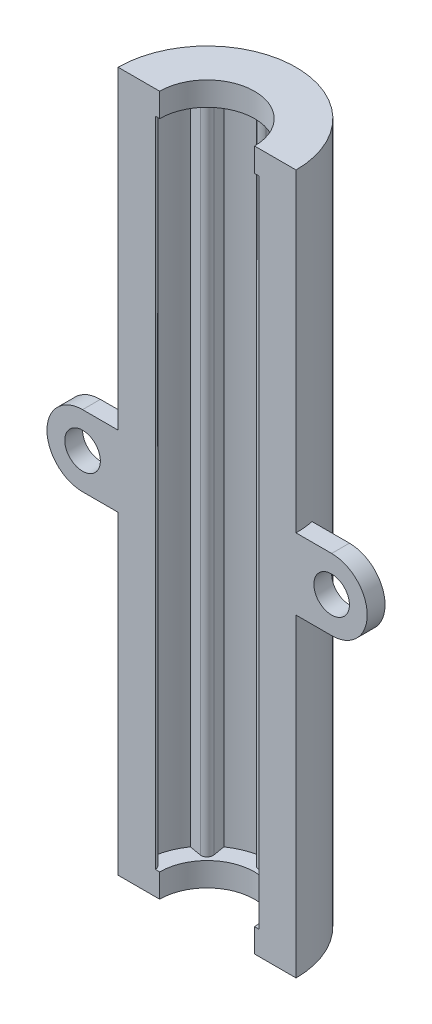
ISO-10303-21;
HEADER;
FILE_DESCRIPTION(('STEP AP214'),'2;1');
FILE_NAME('part.step','',(''),(''),'','','');
FILE_SCHEMA(('AUTOMOTIVE_DESIGN { 1 0 10303 214 1 1 1 1 }'));
ENDSEC;
DATA;
#1=APPLICATION_CONTEXT('core data for automotive mechanical design processes');
#2=APPLICATION_PROTOCOL_DEFINITION('international standard','automotive_design',2000,#1);
#3=PRODUCT_CONTEXT('',#1,'mechanical');
#4=PRODUCT('Part','Part','',(#3));
#5=PRODUCT_RELATED_PRODUCT_CATEGORY('part','',(#4));
#6=PRODUCT_DEFINITION_FORMATION('','',#4);
#7=PRODUCT_DEFINITION_CONTEXT('part definition',#1,'design');
#8=PRODUCT_DEFINITION('design','',#6,#7);
#9=PRODUCT_DEFINITION_SHAPE('','',#8);
#10=(LENGTH_UNIT() NAMED_UNIT(*) SI_UNIT(.MILLI.,.METRE.));
#11=(NAMED_UNIT(*) PLANE_ANGLE_UNIT() SI_UNIT($,.RADIAN.));
#12=(NAMED_UNIT(*) SI_UNIT($,.STERADIAN.) SOLID_ANGLE_UNIT());
#13=UNCERTAINTY_MEASURE_WITH_UNIT(LENGTH_MEASURE(1.E-05),#10,'distance_accuracy_value','');
#14=(GEOMETRIC_REPRESENTATION_CONTEXT(3) GLOBAL_UNCERTAINTY_ASSIGNED_CONTEXT((#13)) GLOBAL_UNIT_ASSIGNED_CONTEXT((#10,
#11,#12)) REPRESENTATION_CONTEXT('',''));
#15=CARTESIAN_POINT('',(0.,0.,0.));
#16=DIRECTION('',(0.,0.,1.));
#17=DIRECTION('',(1.,0.,0.));
#18=AXIS2_PLACEMENT_3D('',#15,#16,#17);
#19=CARTESIAN_POINT('',(0.,55.,0.));
#20=DIRECTION('',(0.,-1.,0.));
#21=DIRECTION('',(0.,0.,-1.));
#22=AXIS2_PLACEMENT_3D('',#19,#20,#21);
#23=CYLINDRICAL_SURFACE('',#22,7.5);
#24=CARTESIAN_POINT('',(0.,57.,0.));
#25=DIRECTION('',(0.,1.,0.));
#26=DIRECTION('',(0.,0.,1.));
#27=AXIS2_PLACEMENT_3D('',#24,#25,#26);
#28=CIRCLE('',#27,7.5);
#29=CARTESIAN_POINT('',(7.5,57.,0.));
#30=VERTEX_POINT('',#29);
#31=CARTESIAN_POINT('',(-7.5,57.,0.));
#32=VERTEX_POINT('',#31);
#33=EDGE_CURVE('E270',#30,#32,#28,.T.);
#34=ORIENTED_EDGE('',*,*,#33,.F.);
#35=DIRECTION('',(0.,-1.,0.));
#36=VECTOR('',#35,1.);
#37=CARTESIAN_POINT('',(7.5,55.,0.));
#38=LINE('',#37,#36);
#39=CARTESIAN_POINT('',(7.5,30.5,0.));
#40=VERTEX_POINT('',#39);
#41=EDGE_CURVE('E253',#30,#40,#38,.T.);
#42=ORIENTED_EDGE('',*,*,#41,.T.);
#43=CARTESIAN_POINT('',(0.,30.5,0.));
#44=DIRECTION('',(0.,1.,0.));
#45=DIRECTION('',(0.,0.,1.));
#46=AXIS2_PLACEMENT_3D('',#43,#44,#45);
#47=CIRCLE('',#46,7.5);
#48=CARTESIAN_POINT('',(7.34846922834953,30.5,-1.5));
#49=VERTEX_POINT('',#48);
#50=EDGE_CURVE('E417',#40,#49,#47,.T.);
#51=ORIENTED_EDGE('',*,*,#50,.T.);
#52=DIRECTION('',(0.,-1.,0.));
#53=VECTOR('',#52,1.);
#54=CARTESIAN_POINT('',(7.34846922834953,55.,-1.5));
#55=LINE('',#54,#53);
#56=CARTESIAN_POINT('',(7.34846922834953,24.5,-1.5));
#57=VERTEX_POINT('',#56);
#58=EDGE_CURVE('E384',#57,#49,#55,.F.);
#59=ORIENTED_EDGE('',*,*,#58,.F.);
#60=CARTESIAN_POINT('',(0.,24.5,0.));
#61=DIRECTION('',(0.,1.,0.));
#62=DIRECTION('',(0.,0.,1.));
#63=AXIS2_PLACEMENT_3D('',#60,#61,#62);
#64=CIRCLE('',#63,7.5);
#65=CARTESIAN_POINT('',(7.5,24.5,0.));
#66=VERTEX_POINT('',#65);
#67=EDGE_CURVE('E419',#66,#57,#64,.T.);
#68=ORIENTED_EDGE('',*,*,#67,.F.);
#69=CARTESIAN_POINT('',(7.5,-2.,0.));
#70=VERTEX_POINT('',#69);
#71=EDGE_CURVE('E263',#66,#70,#38,.T.);
#72=ORIENTED_EDGE('',*,*,#71,.T.);
#73=CARTESIAN_POINT('',(0.,-2.,0.));
#74=DIRECTION('',(0.,1.,0.));
#75=DIRECTION('',(0.,0.,1.));
#76=AXIS2_PLACEMENT_3D('',#73,#74,#75);
#77=CIRCLE('',#76,7.5);
#78=CARTESIAN_POINT('',(-7.5,-2.,0.));
#79=VERTEX_POINT('',#78);
#80=EDGE_CURVE('E289',#70,#79,#77,.T.);
#81=ORIENTED_EDGE('',*,*,#80,.T.);
#82=DIRECTION('',(0.,-1.,0.));
#83=VECTOR('',#82,1.);
#84=CARTESIAN_POINT('',(-7.5,55.,0.));
#85=LINE('',#84,#83);
#86=CARTESIAN_POINT('',(-7.5,24.5,0.));
#87=VERTEX_POINT('',#86);
#88=EDGE_CURVE('E434',#79,#87,#85,.F.);
#89=ORIENTED_EDGE('',*,*,#88,.T.);
#90=CARTESIAN_POINT('',(0.,24.5,0.));
#91=DIRECTION('',(0.,1.,0.));
#92=DIRECTION('',(0.,0.,1.));
#93=AXIS2_PLACEMENT_3D('',#90,#91,#92);
#94=CIRCLE('',#93,7.5);
#95=CARTESIAN_POINT('',(-7.34846922834953,24.5,-1.5));
#96=VERTEX_POINT('',#95);
#97=EDGE_CURVE('E54',#96,#87,#94,.T.);
#98=ORIENTED_EDGE('',*,*,#97,.F.);
#99=DIRECTION('',(0.,-1.,0.));
#100=VECTOR('',#99,1.);
#101=CARTESIAN_POINT('',(-7.34846922834953,55.,-1.5));
#102=LINE('',#101,#100);
#103=CARTESIAN_POINT('',(-7.34846922834953,30.5,-1.5));
#104=VERTEX_POINT('',#103);
#105=EDGE_CURVE('E421',#104,#96,#102,.T.);
#106=ORIENTED_EDGE('',*,*,#105,.F.);
#107=CARTESIAN_POINT('',(0.,30.5,0.));
#108=DIRECTION('',(0.,1.,0.));
#109=DIRECTION('',(0.,0.,1.));
#110=AXIS2_PLACEMENT_3D('',#107,#108,#109);
#111=CIRCLE('',#110,7.5);
#112=CARTESIAN_POINT('',(-7.5,30.5,0.));
#113=VERTEX_POINT('',#112);
#114=EDGE_CURVE('E12',#104,#113,#111,.T.);
#115=ORIENTED_EDGE('',*,*,#114,.T.);
#116=EDGE_CURVE('E277',#113,#32,#85,.F.);
#117=ORIENTED_EDGE('',*,*,#116,.T.);
#118=EDGE_LOOP('',(#34,#42,#51,#59,#68,#72,#81,#89,#98,#106,#115,#117));
#119=FACE_BOUND('',#118,.T.);
#120=ADVANCED_FACE('F46',(#119),#23,.T.);
#121=CARTESIAN_POINT('',(-3.43910141338459,0.,-3.43910141338459));
#122=DIRECTION('',(0.,1.,0.));
#123=DIRECTION('',(0.,0.,1.));
#124=AXIS2_PLACEMENT_3D('',#121,#122,#123);
#125=CYLINDRICAL_SURFACE('',#124,0.5);
#126=CARTESIAN_POINT('',(-3.43910141338459,55.,-3.43910141338459));
#127=DIRECTION('',(0.,1.,0.));
#128=DIRECTION('',(0.,0.,1.));
#129=AXIS2_PLACEMENT_3D('',#126,#127,#128);
#130=CIRCLE('',#129,0.5);
#131=CARTESIAN_POINT('',(-3.52268257129335,55.,-2.94613671886516));
#132=VERTEX_POINT('',#131);
#133=CARTESIAN_POINT('',(-2.94613671886516,55.,-3.52268257129334));
#134=VERTEX_POINT('',#133);
#135=EDGE_CURVE('E293',#132,#134,#130,.T.);
#136=ORIENTED_EDGE('',*,*,#135,.F.);
#137=DIRECTION('',(0.,1.,0.));
#138=VECTOR('',#137,1.);
#139=CARTESIAN_POINT('',(-3.52268257129334,0.,-2.94613671886516));
#140=LINE('',#139,#138);
#141=CARTESIAN_POINT('',(-3.52268257129334,0.,-2.94613671886516));
#142=VERTEX_POINT('',#141);
#143=EDGE_CURVE('E338',#142,#132,#140,.T.);
#144=ORIENTED_EDGE('',*,*,#143,.F.);
#145=CARTESIAN_POINT('',(-3.43910141338459,0.,-3.43910141338459));
#146=DIRECTION('',(0.,1.,0.));
#147=DIRECTION('',(0.,0.,1.));
#148=AXIS2_PLACEMENT_3D('',#145,#146,#147);
#149=CIRCLE('',#148,0.5);
#150=CARTESIAN_POINT('',(-2.94613671886516,0.,-3.52268257129334));
#151=VERTEX_POINT('',#150);
#152=EDGE_CURVE('E294',#142,#151,#149,.T.);
#153=ORIENTED_EDGE('',*,*,#152,.T.);
#154=DIRECTION('',(0.,1.,0.));
#155=VECTOR('',#154,1.);
#156=CARTESIAN_POINT('',(-2.94613671886516,0.,-3.52268257129334));
#157=LINE('',#156,#155);
#158=EDGE_CURVE('E381',#151,#134,#157,.T.);
#159=ORIENTED_EDGE('',*,*,#158,.T.);
#160=EDGE_LOOP('',(#136,#144,#153,#159));
#161=FACE_BOUND('',#160,.T.);
#162=ADVANCED_FACE('F523',(#161),#125,.T.);
#163=CARTESIAN_POINT('',(-2.28323795427809,0.,0.38711833549419));
#164=DIRECTION('',(0.985929389038856,0.,-0.167162315817495));
#165=DIRECTION('',(-0.167162315817495,0.,-0.985929389038856));
#166=AXIS2_PLACEMENT_3D('',#163,#164,#165);
#167=PLANE('',#166);
#168=DIRECTION('',(-0.167162315817495,0.,-0.985929389038856));
#169=VECTOR('',#168,1.);
#170=CARTESIAN_POINT('',(-2.28323795427809,55.,0.38711833549419));
#171=LINE('',#170,#169);
#172=CARTESIAN_POINT('',(-3.11715785400804,55.,-4.53137141638114));
#173=VERTEX_POINT('',#172);
#174=EDGE_CURVE('E298',#134,#173,#171,.T.);
#175=ORIENTED_EDGE('',*,*,#174,.F.);
#176=ORIENTED_EDGE('',*,*,#158,.F.);
#177=DIRECTION('',(-0.167162315817495,0.,-0.985929389038856));
#178=VECTOR('',#177,1.);
#179=CARTESIAN_POINT('',(-2.28323795427809,0.,0.38711833549419));
#180=LINE('',#179,#178);
#181=CARTESIAN_POINT('',(-3.11715785400804,0.,-4.53137141638114));
#182=VERTEX_POINT('',#181);
#183=EDGE_CURVE('E335',#151,#182,#180,.T.);
#184=ORIENTED_EDGE('',*,*,#183,.T.);
#185=DIRECTION('',(0.,1.,0.));
#186=VECTOR('',#185,1.);
#187=CARTESIAN_POINT('',(-3.11715785400804,0.,-4.53137141638114));
#188=LINE('',#187,#186);
#189=EDGE_CURVE('E385',#182,#173,#188,.T.);
#190=ORIENTED_EDGE('',*,*,#189,.T.);
#191=EDGE_LOOP('',(#175,#176,#184,#190));
#192=FACE_BOUND('',#191,.T.);
#193=ADVANCED_FACE('F528',(#192),#167,.T.);
#194=CARTESIAN_POINT('',(0.,0.,0.));
#195=DIRECTION('',(0.,1.,0.));
#196=DIRECTION('',(0.,0.,1.));
#197=AXIS2_PLACEMENT_3D('',#194,#195,#196);
#198=CYLINDRICAL_SURFACE('',#197,5.5);
#199=CARTESIAN_POINT('',(0.,55.,0.));
#200=DIRECTION('',(0.,1.,0.));
#201=DIRECTION('',(0.,0.,1.));
#202=AXIS2_PLACEMENT_3D('',#199,#200,#201);
#203=CIRCLE('',#202,5.5);
#204=CARTESIAN_POINT('',(-1.,55.,-5.40832691319598));
#205=VERTEX_POINT('',#204);
#206=EDGE_CURVE('E348',#205,#173,#203,.T.);
#207=ORIENTED_EDGE('',*,*,#206,.T.);
#208=ORIENTED_EDGE('',*,*,#189,.F.);
#209=CARTESIAN_POINT('',(0.,0.,0.));
#210=DIRECTION('',(0.,1.,0.));
#211=DIRECTION('',(0.,0.,1.));
#212=AXIS2_PLACEMENT_3D('',#209,#210,#211);
#213=CIRCLE('',#212,5.5);
#214=CARTESIAN_POINT('',(-0.999999999999999,0.,-5.40832691319598));
#215=VERTEX_POINT('',#214);
#216=EDGE_CURVE('E304',#215,#182,#213,.T.);
#217=ORIENTED_EDGE('',*,*,#216,.F.);
#218=DIRECTION('',(0.,1.,0.));
#219=VECTOR('',#218,1.);
#220=CARTESIAN_POINT('',(-1.,0.,-5.40832691319598));
#221=LINE('',#220,#219);
#222=EDGE_CURVE('E387',#215,#205,#221,.T.);
#223=ORIENTED_EDGE('',*,*,#222,.T.);
#224=EDGE_LOOP('',(#207,#208,#217,#223));
#225=FACE_BOUND('',#224,.T.);
#226=ADVANCED_FACE('F532',(#225),#198,.F.);
#227=CARTESIAN_POINT('',(1.88822704068213,0.,-1.34075904038295));
#228=DIRECTION('',(-0.815358963833883,0.,0.578955749687088));
#229=DIRECTION('',(0.578955749687088,0.,0.815358963833882));
#230=AXIS2_PLACEMENT_3D('',#227,#228,#229);
#231=PLANE('',#230);
#232=DIRECTION('',(0.578955749687088,0.,0.815358963833882));
#233=VECTOR('',#232,1.);
#234=CARTESIAN_POINT('',(1.88822704068213,55.,-1.34075904038295));
#235=LINE('',#234,#233);
#236=CARTESIAN_POINT('',(-0.407679481916945,55.,-4.57414598634143));
#237=VERTEX_POINT('',#236);
#238=EDGE_CURVE('E376',#205,#237,#235,.T.);
#239=ORIENTED_EDGE('',*,*,#238,.F.);
#240=ORIENTED_EDGE('',*,*,#222,.F.);
#241=DIRECTION('',(0.578955749687088,0.,0.815358963833882));
#242=VECTOR('',#241,1.);
#243=CARTESIAN_POINT('',(1.88822704068213,0.,-1.34075904038295));
#244=LINE('',#243,#242);
#245=CARTESIAN_POINT('',(-0.407679481916945,0.,-4.57414598634143));
#246=VERTEX_POINT('',#245);
#247=EDGE_CURVE('E332',#215,#246,#244,.T.);
#248=ORIENTED_EDGE('',*,*,#247,.T.);
#249=DIRECTION('',(0.,1.,0.));
#250=VECTOR('',#249,1.);
#251=CARTESIAN_POINT('',(-0.407679481916945,0.,-4.57414598634143));
#252=LINE('',#251,#250);
#253=EDGE_CURVE('E389',#246,#237,#252,.T.);
#254=ORIENTED_EDGE('',*,*,#253,.T.);
#255=EDGE_LOOP('',(#239,#240,#248,#254));
#256=FACE_BOUND('',#255,.T.);
#257=ADVANCED_FACE('F580',(#256),#231,.T.);
#258=CARTESIAN_POINT('',(0.,0.,-4.86362386118497));
#259=DIRECTION('',(0.,1.,0.));
#260=DIRECTION('',(0.,0.,1.));
#261=AXIS2_PLACEMENT_3D('',#258,#259,#260);
#262=CYLINDRICAL_SURFACE('',#261,0.5);
#263=CARTESIAN_POINT('',(0.,55.,-4.86362386118497));
#264=DIRECTION('',(0.,1.,0.));
#265=DIRECTION('',(0.,0.,1.));
#266=AXIS2_PLACEMENT_3D('',#263,#264,#265);
#267=CIRCLE('',#266,0.5);
#268=CARTESIAN_POINT('',(0.407679481916944,55.,-4.57414598634143));
#269=VERTEX_POINT('',#268);
#270=EDGE_CURVE('E373',#237,#269,#267,.T.);
#271=ORIENTED_EDGE('',*,*,#270,.F.);
#272=ORIENTED_EDGE('',*,*,#253,.F.);
#273=CARTESIAN_POINT('',(0.,0.,-4.86362386118497));
#274=DIRECTION('',(0.,1.,0.));
#275=DIRECTION('',(0.,0.,1.));
#276=AXIS2_PLACEMENT_3D('',#273,#274,#275);
#277=CIRCLE('',#276,0.5);
#278=CARTESIAN_POINT('',(0.407679481916945,0.,-4.57414598634143));
#279=VERTEX_POINT('',#278);
#280=EDGE_CURVE('E329',#246,#279,#277,.T.);
#281=ORIENTED_EDGE('',*,*,#280,.T.);
#282=DIRECTION('',(0.,1.,0.));
#283=VECTOR('',#282,1.);
#284=CARTESIAN_POINT('',(0.407679481916944,0.,-4.57414598634143));
#285=LINE('',#284,#283);
#286=EDGE_CURVE('E391',#279,#269,#285,.T.);
#287=ORIENTED_EDGE('',*,*,#286,.T.);
#288=EDGE_LOOP('',(#271,#272,#281,#287));
#289=FACE_BOUND('',#288,.T.);
#290=ADVANCED_FACE('F575',(#289),#262,.T.);
#291=CARTESIAN_POINT('',(-1.88822704068213,0.,-1.34075904038295));
#292=DIRECTION('',(0.815358963833883,0.,0.578955749687087));
#293=DIRECTION('',(0.578955749687087,0.,-0.815358963833883));
#294=AXIS2_PLACEMENT_3D('',#291,#292,#293);
#295=PLANE('',#294);
#296=DIRECTION('',(0.578955749687087,0.,-0.815358963833883));
#297=VECTOR('',#296,1.);
#298=CARTESIAN_POINT('',(-1.88822704068213,55.,-1.34075904038295));
#299=LINE('',#298,#297);
#300=CARTESIAN_POINT('',(1.,55.,-5.40832691319598));
#301=VERTEX_POINT('',#300);
#302=EDGE_CURVE('E370',#269,#301,#299,.T.);
#303=ORIENTED_EDGE('',*,*,#302,.F.);
#304=ORIENTED_EDGE('',*,*,#286,.F.);
#305=DIRECTION('',(0.578955749687087,0.,-0.815358963833883));
#306=VECTOR('',#305,1.);
#307=CARTESIAN_POINT('',(-1.88822704068213,0.,-1.34075904038295));
#308=LINE('',#307,#306);
#309=CARTESIAN_POINT('',(1.,0.,-5.40832691319598));
#310=VERTEX_POINT('',#309);
#311=EDGE_CURVE('E326',#279,#310,#308,.T.);
#312=ORIENTED_EDGE('',*,*,#311,.T.);
#313=DIRECTION('',(0.,1.,0.));
#314=VECTOR('',#313,1.);
#315=CARTESIAN_POINT('',(1.,0.,-5.40832691319598));
#316=LINE('',#315,#314);
#317=EDGE_CURVE('E393',#310,#301,#316,.T.);
#318=ORIENTED_EDGE('',*,*,#317,.T.);
#319=EDGE_LOOP('',(#303,#304,#312,#318));
#320=FACE_BOUND('',#319,.T.);
#321=ADVANCED_FACE('F566',(#320),#295,.T.);
#322=CARTESIAN_POINT('',(3.11715785400804,55.,-4.53137141638114));
#323=VERTEX_POINT('',#322);
#324=EDGE_CURVE('E369',#323,#301,#203,.T.);
#325=ORIENTED_EDGE('',*,*,#324,.T.);
#326=ORIENTED_EDGE('',*,*,#317,.F.);
#327=CARTESIAN_POINT('',(3.11715785400804,0.,-4.53137141638114));
#328=VERTEX_POINT('',#327);
#329=EDGE_CURVE('E325',#328,#310,#213,.T.);
#330=ORIENTED_EDGE('',*,*,#329,.F.);
#331=DIRECTION('',(0.,1.,0.));
#332=VECTOR('',#331,1.);
#333=CARTESIAN_POINT('',(3.11715785400804,0.,-4.53137141638114));
#334=LINE('',#333,#332);
#335=EDGE_CURVE('E395',#328,#323,#334,.T.);
#336=ORIENTED_EDGE('',*,*,#335,.T.);
#337=EDGE_LOOP('',(#325,#326,#330,#336));
#338=FACE_BOUND('',#337,.T.);
#339=ADVANCED_FACE('F567',(#338),#198,.F.);
#340=CARTESIAN_POINT('',(2.28323795427809,0.,0.387118335494188));
#341=DIRECTION('',(-0.985929389038856,0.,-0.167162315817494));
#342=DIRECTION('',(-0.167162315817494,0.,0.985929389038856));
#343=AXIS2_PLACEMENT_3D('',#340,#341,#342);
#344=PLANE('',#343);
#345=DIRECTION('',(-0.167162315817494,0.,0.985929389038856));
#346=VECTOR('',#345,1.);
#347=CARTESIAN_POINT('',(2.28323795427809,55.,0.387118335494188));
#348=LINE('',#347,#346);
#349=CARTESIAN_POINT('',(2.94613671886516,55.,-3.52268257129334));
#350=VERTEX_POINT('',#349);
#351=EDGE_CURVE('E366',#323,#350,#348,.T.);
#352=ORIENTED_EDGE('',*,*,#351,.F.);
#353=ORIENTED_EDGE('',*,*,#335,.F.);
#354=DIRECTION('',(-0.167162315817494,0.,0.985929389038856));
#355=VECTOR('',#354,1.);
#356=CARTESIAN_POINT('',(2.28323795427809,0.,0.387118335494188));
#357=LINE('',#356,#355);
#358=CARTESIAN_POINT('',(2.94613671886516,0.,-3.52268257129334));
#359=VERTEX_POINT('',#358);
#360=EDGE_CURVE('E322',#328,#359,#357,.T.);
#361=ORIENTED_EDGE('',*,*,#360,.T.);
#362=DIRECTION('',(0.,1.,0.));
#363=VECTOR('',#362,1.);
#364=CARTESIAN_POINT('',(2.94613671886516,0.,-3.52268257129334));
#365=LINE('',#364,#363);
#366=EDGE_CURVE('E397',#359,#350,#365,.T.);
#367=ORIENTED_EDGE('',*,*,#366,.T.);
#368=EDGE_LOOP('',(#352,#353,#361,#367));
#369=FACE_BOUND('',#368,.T.);
#370=ADVANCED_FACE('F560',(#369),#344,.T.);
#371=CARTESIAN_POINT('',(3.43910141338459,0.,-3.43910141338459));
#372=DIRECTION('',(0.,1.,0.));
#373=DIRECTION('',(0.,0.,1.));
#374=AXIS2_PLACEMENT_3D('',#371,#372,#373);
#375=CYLINDRICAL_SURFACE('',#374,0.5);
#376=CARTESIAN_POINT('',(3.43910141338459,55.,-3.43910141338459));
#377=DIRECTION('',(0.,1.,0.));
#378=DIRECTION('',(0.,0.,1.));
#379=AXIS2_PLACEMENT_3D('',#376,#377,#378);
#380=CIRCLE('',#379,0.5);
#381=CARTESIAN_POINT('',(3.52268257129334,55.,-2.94613671886516));
#382=VERTEX_POINT('',#381);
#383=EDGE_CURVE('E363',#350,#382,#380,.T.);
#384=ORIENTED_EDGE('',*,*,#383,.F.);
#385=ORIENTED_EDGE('',*,*,#366,.F.);
#386=CARTESIAN_POINT('',(3.43910141338459,0.,-3.43910141338459));
#387=DIRECTION('',(0.,1.,0.));
#388=DIRECTION('',(0.,0.,1.));
#389=AXIS2_PLACEMENT_3D('',#386,#387,#388);
#390=CIRCLE('',#389,0.5);
#391=CARTESIAN_POINT('',(3.52268257129334,0.,-2.94613671886516));
#392=VERTEX_POINT('',#391);
#393=EDGE_CURVE('E319',#359,#392,#390,.T.);
#394=ORIENTED_EDGE('',*,*,#393,.T.);
#395=DIRECTION('',(0.,1.,0.));
#396=VECTOR('',#395,1.);
#397=CARTESIAN_POINT('',(3.52268257129334,0.,-2.94613671886516));
#398=LINE('',#397,#396);
#399=EDGE_CURVE('E399',#392,#382,#398,.T.);
#400=ORIENTED_EDGE('',*,*,#399,.T.);
#401=EDGE_LOOP('',(#384,#385,#394,#400));
#402=FACE_BOUND('',#401,.T.);
#403=ADVANCED_FACE('F557',(#402),#375,.T.);
#404=CARTESIAN_POINT('',(-0.387118335494189,0.,-2.28323795427809));
#405=DIRECTION('',(0.167162315817495,0.,0.985929389038856));
#406=DIRECTION('',(0.985929389038856,0.,-0.167162315817495));
#407=AXIS2_PLACEMENT_3D('',#404,#405,#406);
#408=PLANE('',#407);
#409=DIRECTION('',(0.985929389038856,0.,-0.167162315817495));
#410=VECTOR('',#409,1.);
#411=CARTESIAN_POINT('',(-0.387118335494189,55.,-2.28323795427809));
#412=LINE('',#411,#410);
#413=CARTESIAN_POINT('',(4.53137141638114,55.,-3.11715785400804));
#414=VERTEX_POINT('',#413);
#415=EDGE_CURVE('E360',#382,#414,#412,.T.);
#416=ORIENTED_EDGE('',*,*,#415,.F.);
#417=ORIENTED_EDGE('',*,*,#399,.F.);
#418=DIRECTION('',(0.985929389038856,0.,-0.167162315817495));
#419=VECTOR('',#418,1.);
#420=CARTESIAN_POINT('',(-0.387118335494189,0.,-2.28323795427809));
#421=LINE('',#420,#419);
#422=CARTESIAN_POINT('',(4.53137141638114,0.,-3.11715785400804));
#423=VERTEX_POINT('',#422);
#424=EDGE_CURVE('E316',#392,#423,#421,.T.);
#425=ORIENTED_EDGE('',*,*,#424,.T.);
#426=DIRECTION('',(0.,1.,0.));
#427=VECTOR('',#426,1.);
#428=CARTESIAN_POINT('',(4.53137141638114,0.,-3.11715785400804));
#429=LINE('',#428,#427);
#430=EDGE_CURVE('E401',#423,#414,#429,.T.);
#431=ORIENTED_EDGE('',*,*,#430,.T.);
#432=EDGE_LOOP('',(#416,#417,#425,#431));
#433=FACE_BOUND('',#432,.T.);
#434=ADVANCED_FACE('F551',(#433),#408,.T.);
#435=CARTESIAN_POINT('',(5.40832691319598,55.,-1.));
#436=VERTEX_POINT('',#435);
#437=EDGE_CURVE('E349',#436,#414,#203,.T.);
#438=ORIENTED_EDGE('',*,*,#437,.T.);
#439=ORIENTED_EDGE('',*,*,#430,.F.);
#440=CARTESIAN_POINT('',(5.40832691319598,0.,-1.));
#441=VERTEX_POINT('',#440);
#442=EDGE_CURVE('E305',#441,#423,#213,.T.);
#443=ORIENTED_EDGE('',*,*,#442,.F.);
#444=DIRECTION('',(0.,1.,0.));
#445=VECTOR('',#444,1.);
#446=CARTESIAN_POINT('',(5.40832691319598,0.,-1.));
#447=LINE('',#446,#445);
#448=EDGE_CURVE('E403',#441,#436,#447,.T.);
#449=ORIENTED_EDGE('',*,*,#448,.T.);
#450=EDGE_LOOP('',(#438,#439,#443,#449));
#451=FACE_BOUND('',#450,.T.);
#452=ADVANCED_FACE('F543',(#451),#198,.F.);
#453=CARTESIAN_POINT('',(1.34075904038295,0.,1.88822704068213));
#454=DIRECTION('',(-0.578955749687088,0.,-0.815358963833882));
#455=DIRECTION('',(-0.815358963833882,0.,0.578955749687088));
#456=AXIS2_PLACEMENT_3D('',#453,#454,#455);
#457=PLANE('',#456);
#458=DIRECTION('',(-0.815358963833882,0.,0.578955749687088));
#459=VECTOR('',#458,1.);
#460=CARTESIAN_POINT('',(1.34075904038295,55.,1.88822704068213));
#461=LINE('',#460,#459);
#462=CARTESIAN_POINT('',(4.57414598634143,55.,-0.407679481916946));
#463=VERTEX_POINT('',#462);
#464=EDGE_CURVE('E357',#436,#463,#461,.T.);
#465=ORIENTED_EDGE('',*,*,#464,.F.);
#466=ORIENTED_EDGE('',*,*,#448,.F.);
#467=DIRECTION('',(-0.815358963833882,0.,0.578955749687088));
#468=VECTOR('',#467,1.);
#469=CARTESIAN_POINT('',(1.34075904038295,0.,1.88822704068213));
#470=LINE('',#469,#468);
#471=CARTESIAN_POINT('',(4.57414598634143,0.,-0.407679481916946));
#472=VERTEX_POINT('',#471);
#473=EDGE_CURVE('E313',#441,#472,#470,.T.);
#474=ORIENTED_EDGE('',*,*,#473,.T.);
#475=DIRECTION('',(0.,1.,0.));
#476=VECTOR('',#475,1.);
#477=CARTESIAN_POINT('',(4.57414598634143,0.,-0.407679481916946));
#478=LINE('',#477,#476);
#479=EDGE_CURVE('E405',#472,#463,#478,.T.);
#480=ORIENTED_EDGE('',*,*,#479,.T.);
#481=EDGE_LOOP('',(#465,#466,#474,#480));
#482=FACE_BOUND('',#481,.T.);
#483=ADVANCED_FACE('F582',(#482),#457,.T.);
#484=CARTESIAN_POINT('',(4.86362386118497,0.,0.));
#485=DIRECTION('',(0.,1.,0.));
#486=DIRECTION('',(0.,0.,1.));
#487=AXIS2_PLACEMENT_3D('',#484,#485,#486);
#488=CYLINDRICAL_SURFACE('',#487,0.5);
#489=DIRECTION('',(0.,1.,0.));
#490=VECTOR('',#489,1.);
#491=CARTESIAN_POINT('',(4.36362386118497,0.,0.));
#492=LINE('',#491,#490);
#493=CARTESIAN_POINT('',(4.36362386118497,55.,0.));
#494=VERTEX_POINT('',#493);
#495=CARTESIAN_POINT('',(4.36362386118497,0.,0.));
#496=VERTEX_POINT('',#495);
#497=EDGE_CURVE('E486',#494,#496,#492,.F.);
#498=ORIENTED_EDGE('',*,*,#497,.F.);
#499=CARTESIAN_POINT('',(4.86362386118497,55.,0.));
#500=DIRECTION('',(0.,1.,0.));
#501=DIRECTION('',(0.,0.,1.));
#502=AXIS2_PLACEMENT_3D('',#499,#500,#501);
#503=CIRCLE('',#502,0.5);
#504=EDGE_CURVE('E354',#463,#494,#503,.T.);
#505=ORIENTED_EDGE('',*,*,#504,.F.);
#506=ORIENTED_EDGE('',*,*,#479,.F.);
#507=CARTESIAN_POINT('',(4.86362386118497,0.,0.));
#508=DIRECTION('',(0.,1.,0.));
#509=DIRECTION('',(0.,0.,1.));
#510=AXIS2_PLACEMENT_3D('',#507,#508,#509);
#511=CIRCLE('',#510,0.5);
#512=EDGE_CURVE('E310',#472,#496,#511,.T.);
#513=ORIENTED_EDGE('',*,*,#512,.T.);
#514=EDGE_LOOP('',(#498,#505,#506,#513));
#515=FACE_BOUND('',#514,.T.);
#516=ADVANCED_FACE('F598',(#515),#488,.T.);
#517=CARTESIAN_POINT('',(-4.86362386118497,0.,0.));
#518=DIRECTION('',(0.,1.,0.));
#519=DIRECTION('',(0.,0.,1.));
#520=AXIS2_PLACEMENT_3D('',#517,#518,#519);
#521=CYLINDRICAL_SURFACE('',#520,0.5);
#522=DIRECTION('',(0.,1.,0.));
#523=VECTOR('',#522,1.);
#524=CARTESIAN_POINT('',(-4.36362386118497,0.,0.));
#525=LINE('',#524,#523);
#526=CARTESIAN_POINT('',(-4.36362386118497,0.,0.));
#527=VERTEX_POINT('',#526);
#528=CARTESIAN_POINT('',(-4.36362386118497,55.,0.));
#529=VERTEX_POINT('',#528);
#530=EDGE_CURVE('E497',#527,#529,#525,.T.);
#531=ORIENTED_EDGE('',*,*,#530,.F.);
#532=CARTESIAN_POINT('',(-4.86362386118497,0.,0.));
#533=DIRECTION('',(0.,1.,0.));
#534=DIRECTION('',(0.,0.,1.));
#535=AXIS2_PLACEMENT_3D('',#532,#533,#534);
#536=CIRCLE('',#535,0.5);
#537=CARTESIAN_POINT('',(-4.57414598634143,0.,-0.407679481916945));
#538=VERTEX_POINT('',#537);
#539=EDGE_CURVE('E308',#527,#538,#536,.T.);
#540=ORIENTED_EDGE('',*,*,#539,.T.);
#541=DIRECTION('',(0.,1.,0.));
#542=VECTOR('',#541,1.);
#543=CARTESIAN_POINT('',(-4.57414598634143,0.,-0.407679481916944));
#544=LINE('',#543,#542);
#545=CARTESIAN_POINT('',(-4.57414598634143,55.,-0.407679481916944));
#546=VERTEX_POINT('',#545);
#547=EDGE_CURVE('E407',#538,#546,#544,.T.);
#548=ORIENTED_EDGE('',*,*,#547,.T.);
#549=CARTESIAN_POINT('',(-4.86362386118497,55.,0.));
#550=DIRECTION('',(0.,1.,0.));
#551=DIRECTION('',(0.,0.,1.));
#552=AXIS2_PLACEMENT_3D('',#549,#550,#551);
#553=CIRCLE('',#552,0.5);
#554=EDGE_CURVE('E352',#529,#546,#553,.T.);
#555=ORIENTED_EDGE('',*,*,#554,.F.);
#556=EDGE_LOOP('',(#531,#540,#548,#555));
#557=FACE_BOUND('',#556,.T.);
#558=ADVANCED_FACE('F504',(#557),#521,.T.);
#559=CARTESIAN_POINT('',(-1.34075904038295,0.,1.88822704068213));
#560=DIRECTION('',(0.578955749687087,0.,-0.815358963833883));
#561=DIRECTION('',(-0.815358963833883,0.,-0.578955749687087));
#562=AXIS2_PLACEMENT_3D('',#559,#560,#561);
#563=PLANE('',#562);
#564=DIRECTION('',(-0.815358963833883,0.,-0.578955749687087));
#565=VECTOR('',#564,1.);
#566=CARTESIAN_POINT('',(-1.34075904038295,55.,1.88822704068213));
#567=LINE('',#566,#565);
#568=CARTESIAN_POINT('',(-5.40832691319598,55.,-0.999999999999999));
#569=VERTEX_POINT('',#568);
#570=EDGE_CURVE('E347',#546,#569,#567,.T.);
#571=ORIENTED_EDGE('',*,*,#570,.F.);
#572=ORIENTED_EDGE('',*,*,#547,.F.);
#573=DIRECTION('',(-0.815358963833883,0.,-0.578955749687087));
#574=VECTOR('',#573,1.);
#575=CARTESIAN_POINT('',(-1.34075904038295,0.,1.88822704068213));
#576=LINE('',#575,#574);
#577=CARTESIAN_POINT('',(-5.40832691319598,0.,-0.999999999999999));
#578=VERTEX_POINT('',#577);
#579=EDGE_CURVE('E303',#538,#578,#576,.T.);
#580=ORIENTED_EDGE('',*,*,#579,.T.);
#581=DIRECTION('',(0.,1.,0.));
#582=VECTOR('',#581,1.);
#583=CARTESIAN_POINT('',(-5.40832691319598,0.,-0.999999999999999));
#584=LINE('',#583,#582);
#585=EDGE_CURVE('E410',#578,#569,#584,.T.);
#586=ORIENTED_EDGE('',*,*,#585,.T.);
#587=EDGE_LOOP('',(#571,#572,#580,#586));
#588=FACE_BOUND('',#587,.T.);
#589=ADVANCED_FACE('F510',(#588),#563,.T.);
#590=CARTESIAN_POINT('',(-4.53137141638114,55.,-3.11715785400804));
#591=VERTEX_POINT('',#590);
#592=EDGE_CURVE('E344',#591,#569,#203,.T.);
#593=ORIENTED_EDGE('',*,*,#592,.T.);
#594=ORIENTED_EDGE('',*,*,#585,.F.);
#595=CARTESIAN_POINT('',(-4.53137141638114,0.,-3.11715785400804));
#596=VERTEX_POINT('',#595);
#597=EDGE_CURVE('E301',#596,#578,#213,.T.);
#598=ORIENTED_EDGE('',*,*,#597,.F.);
#599=DIRECTION('',(0.,1.,0.));
#600=VECTOR('',#599,1.);
#601=CARTESIAN_POINT('',(-4.53137141638114,0.,-3.11715785400804));
#602=LINE('',#601,#600);
#603=EDGE_CURVE('E412',#596,#591,#602,.T.);
#604=ORIENTED_EDGE('',*,*,#603,.T.);
#605=EDGE_LOOP('',(#593,#594,#598,#604));
#606=FACE_BOUND('',#605,.T.);
#607=ADVANCED_FACE('F515',(#606),#198,.F.);
#608=CARTESIAN_POINT('',(0.387118335494187,0.,-2.28323795427809));
#609=DIRECTION('',(-0.167162315817494,0.,0.985929389038856));
#610=DIRECTION('',(0.985929389038856,0.,0.167162315817494));
#611=AXIS2_PLACEMENT_3D('',#608,#609,#610);
#612=PLANE('',#611);
#613=DIRECTION('',(0.985929389038856,0.,0.167162315817494));
#614=VECTOR('',#613,1.);
#615=CARTESIAN_POINT('',(0.387118335494187,55.,-2.28323795427809));
#616=LINE('',#615,#614);
#617=EDGE_CURVE('E341',#591,#132,#616,.T.);
#618=ORIENTED_EDGE('',*,*,#617,.F.);
#619=ORIENTED_EDGE('',*,*,#603,.F.);
#620=DIRECTION('',(0.985929389038856,0.,0.167162315817494));
#621=VECTOR('',#620,1.);
#622=CARTESIAN_POINT('',(0.387118335494187,0.,-2.28323795427809));
#623=LINE('',#622,#621);
#624=EDGE_CURVE('E297',#596,#142,#623,.T.);
#625=ORIENTED_EDGE('',*,*,#624,.T.);
#626=ORIENTED_EDGE('',*,*,#143,.T.);
#627=EDGE_LOOP('',(#618,#619,#625,#626));
#628=FACE_BOUND('',#627,.T.);
#629=ADVANCED_FACE('F519',(#628),#612,.T.);
#630=CARTESIAN_POINT('',(0.,-2.,0.));
#631=DIRECTION('',(0.,1.,0.));
#632=DIRECTION('',(0.,0.,1.));
#633=AXIS2_PLACEMENT_3D('',#630,#631,#632);
#634=PLANE('',#633);
#635=ORIENTED_EDGE('',*,*,#80,.F.);
#636=DIRECTION('',(-1.,0.,0.));
#637=VECTOR('',#636,1.);
#638=CARTESIAN_POINT('',(-13.5,-2.,0.));
#639=LINE('',#638,#637);
#640=CARTESIAN_POINT('',(4.,-2.,0.));
#641=VERTEX_POINT('',#640);
#642=EDGE_CURVE('E623',#70,#641,#639,.T.);
#643=ORIENTED_EDGE('',*,*,#642,.T.);
#644=CARTESIAN_POINT('',(0.,-2.,0.));
#645=DIRECTION('',(0.,1.,0.));
#646=DIRECTION('',(0.,0.,1.));
#647=AXIS2_PLACEMENT_3D('',#644,#645,#646);
#648=CIRCLE('',#647,4.);
#649=CARTESIAN_POINT('',(-4.,-2.,0.));
#650=VERTEX_POINT('',#649);
#651=EDGE_CURVE('E282',#641,#650,#648,.T.);
#652=ORIENTED_EDGE('',*,*,#651,.T.);
#653=EDGE_CURVE('E273',#650,#79,#639,.T.);
#654=ORIENTED_EDGE('',*,*,#653,.T.);
#655=EDGE_LOOP('',(#635,#643,#652,#654));
#656=FACE_BOUND('',#655,.T.);
#657=ADVANCED_FACE('F593',(#656),#634,.F.);
#658=CARTESIAN_POINT('',(0.,0.,0.));
#659=DIRECTION('',(0.,1.,0.));
#660=DIRECTION('',(0.,0.,1.));
#661=AXIS2_PLACEMENT_3D('',#658,#659,#660);
#662=PLANE('',#661);
#663=DIRECTION('',(-1.,0.,0.));
#664=VECTOR('',#663,1.);
#665=CARTESIAN_POINT('',(0.,0.,0.));
#666=LINE('',#665,#664);
#667=CARTESIAN_POINT('',(4.,0.,0.));
#668=VERTEX_POINT('',#667);
#669=EDGE_CURVE('E492',#496,#668,#666,.T.);
#670=ORIENTED_EDGE('',*,*,#669,.F.);
#671=ORIENTED_EDGE('',*,*,#512,.F.);
#672=ORIENTED_EDGE('',*,*,#473,.F.);
#673=ORIENTED_EDGE('',*,*,#442,.T.);
#674=ORIENTED_EDGE('',*,*,#424,.F.);
#675=ORIENTED_EDGE('',*,*,#393,.F.);
#676=ORIENTED_EDGE('',*,*,#360,.F.);
#677=ORIENTED_EDGE('',*,*,#329,.T.);
#678=ORIENTED_EDGE('',*,*,#311,.F.);
#679=ORIENTED_EDGE('',*,*,#280,.F.);
#680=ORIENTED_EDGE('',*,*,#247,.F.);
#681=ORIENTED_EDGE('',*,*,#216,.T.);
#682=ORIENTED_EDGE('',*,*,#183,.F.);
#683=ORIENTED_EDGE('',*,*,#152,.F.);
#684=ORIENTED_EDGE('',*,*,#624,.F.);
#685=ORIENTED_EDGE('',*,*,#597,.T.);
#686=ORIENTED_EDGE('',*,*,#579,.F.);
#687=ORIENTED_EDGE('',*,*,#539,.F.);
#688=CARTESIAN_POINT('',(-4.,0.,0.));
#689=VERTEX_POINT('',#688);
#690=EDGE_CURVE('E449',#689,#527,#666,.T.);
#691=ORIENTED_EDGE('',*,*,#690,.F.);
#692=CARTESIAN_POINT('',(0.,0.,0.));
#693=DIRECTION('',(0.,1.,0.));
#694=DIRECTION('',(0.,0.,1.));
#695=AXIS2_PLACEMENT_3D('',#692,#693,#694);
#696=CIRCLE('',#695,4.);
#697=EDGE_CURVE('E278',#668,#689,#696,.T.);
#698=ORIENTED_EDGE('',*,*,#697,.F.);
#699=EDGE_LOOP('',(#670,#671,#672,#673,#674,#675,#676,#677,#678,#679,#680,#681,#682,#683,#684,
#685,#686,#687,#691,#698));
#700=FACE_BOUND('',#699,.T.);
#701=ADVANCED_FACE('F554',(#700),#662,.T.);
#702=CARTESIAN_POINT('',(0.,-2.,0.));
#703=DIRECTION('',(0.,1.,0.));
#704=DIRECTION('',(0.,0.,1.));
#705=AXIS2_PLACEMENT_3D('',#702,#703,#704);
#706=CYLINDRICAL_SURFACE('',#705,4.);
#707=ORIENTED_EDGE('',*,*,#697,.T.);
#708=DIRECTION('',(0.,1.,0.));
#709=VECTOR('',#708,1.);
#710=CARTESIAN_POINT('',(-4.,-2.,0.));
#711=LINE('',#710,#709);
#712=EDGE_CURVE('E445',#689,#650,#711,.F.);
#713=ORIENTED_EDGE('',*,*,#712,.T.);
#714=ORIENTED_EDGE('',*,*,#651,.F.);
#715=DIRECTION('',(0.,1.,0.));
#716=VECTOR('',#715,1.);
#717=CARTESIAN_POINT('',(4.,-2.,0.));
#718=LINE('',#717,#716);
#719=EDGE_CURVE('E494',#641,#668,#718,.T.);
#720=ORIENTED_EDGE('',*,*,#719,.T.);
#721=EDGE_LOOP('',(#707,#713,#714,#720));
#722=FACE_BOUND('',#721,.T.);
#723=ADVANCED_FACE('F620',(#722),#706,.F.);
#724=CARTESIAN_POINT('',(0.,55.,0.));
#725=DIRECTION('',(0.,1.,0.));
#726=DIRECTION('',(0.,0.,1.));
#727=AXIS2_PLACEMENT_3D('',#724,#725,#726);
#728=PLANE('',#727);
#729=ORIENTED_EDGE('',*,*,#504,.T.);
#730=DIRECTION('',(-1.,0.,0.));
#731=VECTOR('',#730,1.);
#732=CARTESIAN_POINT('',(0.,55.,0.));
#733=LINE('',#732,#731);
#734=CARTESIAN_POINT('',(4.,55.,0.));
#735=VERTEX_POINT('',#734);
#736=EDGE_CURVE('E484',#494,#735,#733,.T.);
#737=ORIENTED_EDGE('',*,*,#736,.T.);
#738=CARTESIAN_POINT('',(0.,55.,0.));
#739=DIRECTION('',(0.,1.,0.));
#740=DIRECTION('',(0.,0.,1.));
#741=AXIS2_PLACEMENT_3D('',#738,#739,#740);
#742=CIRCLE('',#741,4.);
#743=CARTESIAN_POINT('',(-4.,55.,0.));
#744=VERTEX_POINT('',#743);
#745=EDGE_CURVE('E279',#735,#744,#742,.T.);
#746=ORIENTED_EDGE('',*,*,#745,.T.);
#747=EDGE_CURVE('E488',#744,#529,#733,.T.);
#748=ORIENTED_EDGE('',*,*,#747,.T.);
#749=ORIENTED_EDGE('',*,*,#554,.T.);
#750=ORIENTED_EDGE('',*,*,#570,.T.);
#751=ORIENTED_EDGE('',*,*,#592,.F.);
#752=ORIENTED_EDGE('',*,*,#617,.T.);
#753=ORIENTED_EDGE('',*,*,#135,.T.);
#754=ORIENTED_EDGE('',*,*,#174,.T.);
#755=ORIENTED_EDGE('',*,*,#206,.F.);
#756=ORIENTED_EDGE('',*,*,#238,.T.);
#757=ORIENTED_EDGE('',*,*,#270,.T.);
#758=ORIENTED_EDGE('',*,*,#302,.T.);
#759=ORIENTED_EDGE('',*,*,#324,.F.);
#760=ORIENTED_EDGE('',*,*,#351,.T.);
#761=ORIENTED_EDGE('',*,*,#383,.T.);
#762=ORIENTED_EDGE('',*,*,#415,.T.);
#763=ORIENTED_EDGE('',*,*,#437,.F.);
#764=ORIENTED_EDGE('',*,*,#464,.T.);
#765=EDGE_LOOP('',(#729,#737,#746,#748,#749,#750,#751,#752,#753,#754,#755,#756,#757,#758,#759,
#760,#761,#762,#763,#764));
#766=FACE_BOUND('',#765,.T.);
#767=ADVANCED_FACE('F502',(#766),#728,.F.);
#768=CARTESIAN_POINT('',(0.,57.,0.));
#769=DIRECTION('',(0.,1.,0.));
#770=DIRECTION('',(0.,0.,1.));
#771=AXIS2_PLACEMENT_3D('',#768,#769,#770);
#772=PLANE('',#771);
#773=DIRECTION('',(-1.,0.,0.));
#774=VECTOR('',#773,1.);
#775=CARTESIAN_POINT('',(-13.5,57.,0.));
#776=LINE('',#775,#774);
#777=CARTESIAN_POINT('',(4.,57.,0.));
#778=VERTEX_POINT('',#777);
#779=EDGE_CURVE('E256',#30,#778,#776,.T.);
#780=ORIENTED_EDGE('',*,*,#779,.F.);
#781=ORIENTED_EDGE('',*,*,#33,.T.);
#782=CARTESIAN_POINT('',(-4.,57.,0.));
#783=VERTEX_POINT('',#782);
#784=EDGE_CURVE('E274',#783,#32,#776,.T.);
#785=ORIENTED_EDGE('',*,*,#784,.F.);
#786=CARTESIAN_POINT('',(0.,57.,0.));
#787=DIRECTION('',(0.,1.,0.));
#788=DIRECTION('',(0.,0.,1.));
#789=AXIS2_PLACEMENT_3D('',#786,#787,#788);
#790=CIRCLE('',#789,4.);
#791=EDGE_CURVE('E272',#778,#783,#790,.T.);
#792=ORIENTED_EDGE('',*,*,#791,.F.);
#793=EDGE_LOOP('',(#780,#781,#785,#792));
#794=FACE_BOUND('',#793,.T.);
#795=ADVANCED_FACE('F268',(#794),#772,.T.);
#796=CARTESIAN_POINT('',(0.,55.,0.));
#797=DIRECTION('',(0.,1.,0.));
#798=DIRECTION('',(0.,0.,1.));
#799=AXIS2_PLACEMENT_3D('',#796,#797,#798);
#800=CYLINDRICAL_SURFACE('',#799,4.);
#801=ORIENTED_EDGE('',*,*,#791,.T.);
#802=DIRECTION('',(0.,1.,0.));
#803=VECTOR('',#802,1.);
#804=CARTESIAN_POINT('',(-4.,55.,0.));
#805=LINE('',#804,#803);
#806=EDGE_CURVE('E482',#783,#744,#805,.F.);
#807=ORIENTED_EDGE('',*,*,#806,.T.);
#808=ORIENTED_EDGE('',*,*,#745,.F.);
#809=DIRECTION('',(0.,1.,0.));
#810=VECTOR('',#809,1.);
#811=CARTESIAN_POINT('',(4.,55.,0.));
#812=LINE('',#811,#810);
#813=EDGE_CURVE('E262',#735,#778,#812,.T.);
#814=ORIENTED_EDGE('',*,*,#813,.T.);
#815=EDGE_LOOP('',(#801,#807,#808,#814));
#816=FACE_BOUND('',#815,.T.);
#817=ADVANCED_FACE('F480',(#816),#800,.F.);
#818=CARTESIAN_POINT('',(0.,0.,-1.5));
#819=DIRECTION('',(0.,0.,1.));
#820=DIRECTION('',(1.,0.,0.));
#821=AXIS2_PLACEMENT_3D('',#818,#819,#820);
#822=PLANE('',#821);
#823=CARTESIAN_POINT('',(10.5,27.5,-1.5));
#824=DIRECTION('',(0.,0.,1.));
#825=DIRECTION('',(1.,0.,0.));
#826=AXIS2_PLACEMENT_3D('',#823,#824,#825);
#827=CIRCLE('',#826,1.5);
#828=CARTESIAN_POINT('',(12.,27.5,-1.5));
#829=VERTEX_POINT('',#828);
#830=EDGE_CURVE('E470',#829,#829,#827,.T.);
#831=ORIENTED_EDGE('',*,*,#830,.T.);
#832=EDGE_LOOP('',(#831));
#833=FACE_BOUND('',#832,.T.);
#834=DIRECTION('',(1.,0.,0.));
#835=VECTOR('',#834,1.);
#836=CARTESIAN_POINT('',(0.,24.5,-1.5));
#837=LINE('',#836,#835);
#838=CARTESIAN_POINT('',(10.5,24.5,-1.5));
#839=VERTEX_POINT('',#838);
#840=EDGE_CURVE('E461',#57,#839,#837,.T.);
#841=ORIENTED_EDGE('',*,*,#840,.F.);
#842=ORIENTED_EDGE('',*,*,#58,.T.);
#843=DIRECTION('',(1.,0.,0.));
#844=VECTOR('',#843,1.);
#845=CARTESIAN_POINT('',(0.,30.5,-1.5));
#846=LINE('',#845,#844);
#847=CARTESIAN_POINT('',(10.5,30.5,-1.5));
#848=VERTEX_POINT('',#847);
#849=EDGE_CURVE('E467',#49,#848,#846,.T.);
#850=ORIENTED_EDGE('',*,*,#849,.T.);
#851=CARTESIAN_POINT('',(10.5,27.5,-1.5));
#852=DIRECTION('',(0.,0.,1.));
#853=DIRECTION('',(1.,0.,0.));
#854=AXIS2_PLACEMENT_3D('',#851,#852,#853);
#855=CIRCLE('',#854,3.);
#856=EDGE_CURVE('E464',#839,#848,#855,.T.);
#857=ORIENTED_EDGE('',*,*,#856,.F.);
#858=EDGE_LOOP('',(#841,#842,#850,#857));
#859=FACE_BOUND('',#858,.T.);
#860=ADVANCED_FACE('F649',(#833,#859),#822,.F.);
#861=CARTESIAN_POINT('',(0.,24.5,1.5));
#862=DIRECTION('',(0.,1.,0.));
#863=DIRECTION('',(0.,0.,1.));
#864=AXIS2_PLACEMENT_3D('',#861,#862,#863);
#865=PLANE('',#864);
#866=DIRECTION('',(0.,0.,-1.));
#867=VECTOR('',#866,1.);
#868=CARTESIAN_POINT('',(10.5,24.5,1.5));
#869=LINE('',#868,#867);
#870=CARTESIAN_POINT('',(10.5,24.5,0.));
#871=VERTEX_POINT('',#870);
#872=EDGE_CURVE('E475',#871,#839,#869,.T.);
#873=ORIENTED_EDGE('',*,*,#872,.F.);
#874=DIRECTION('',(-1.,0.,0.));
#875=VECTOR('',#874,1.);
#876=CARTESIAN_POINT('',(0.,24.5,0.));
#877=LINE('',#876,#875);
#878=EDGE_CURVE('E640',#871,#66,#877,.T.);
#879=ORIENTED_EDGE('',*,*,#878,.T.);
#880=ORIENTED_EDGE('',*,*,#67,.T.);
#881=ORIENTED_EDGE('',*,*,#840,.T.);
#882=EDGE_LOOP('',(#873,#879,#880,#881));
#883=FACE_BOUND('',#882,.T.);
#884=ADVANCED_FACE('F645',(#883),#865,.F.);
#885=CARTESIAN_POINT('',(10.5,27.5,1.5));
#886=DIRECTION('',(0.,0.,-1.));
#887=DIRECTION('',(-1.,0.,0.));
#888=AXIS2_PLACEMENT_3D('',#885,#886,#887);
#889=CYLINDRICAL_SURFACE('',#888,3.);
#890=CARTESIAN_POINT('',(10.5,27.5,0.));
#891=DIRECTION('',(0.,0.,-1.));
#892=DIRECTION('',(-1.,0.,0.));
#893=AXIS2_PLACEMENT_3D('',#890,#891,#892);
#894=CIRCLE('',#893,3.);
#895=CARTESIAN_POINT('',(10.5,30.5,0.));
#896=VERTEX_POINT('',#895);
#897=EDGE_CURVE('E61',#896,#871,#894,.T.);
#898=ORIENTED_EDGE('',*,*,#897,.T.);
#899=ORIENTED_EDGE('',*,*,#872,.T.);
#900=ORIENTED_EDGE('',*,*,#856,.T.);
#901=DIRECTION('',(0.,0.,-1.));
#902=VECTOR('',#901,1.);
#903=CARTESIAN_POINT('',(10.5,30.5,1.5));
#904=LINE('',#903,#902);
#905=EDGE_CURVE('E473',#896,#848,#904,.T.);
#906=ORIENTED_EDGE('',*,*,#905,.F.);
#907=EDGE_LOOP('',(#898,#899,#900,#906));
#908=FACE_BOUND('',#907,.T.);
#909=ADVANCED_FACE('F652',(#908),#889,.T.);
#910=CARTESIAN_POINT('',(0.,30.5,1.5));
#911=DIRECTION('',(0.,1.,0.));
#912=DIRECTION('',(0.,0.,1.));
#913=AXIS2_PLACEMENT_3D('',#910,#911,#912);
#914=PLANE('',#913);
#915=DIRECTION('',(-1.,0.,0.));
#916=VECTOR('',#915,1.);
#917=CARTESIAN_POINT('',(0.,30.5,0.));
#918=LINE('',#917,#916);
#919=EDGE_CURVE('E258',#896,#40,#918,.T.);
#920=ORIENTED_EDGE('',*,*,#919,.F.);
#921=ORIENTED_EDGE('',*,*,#905,.T.);
#922=ORIENTED_EDGE('',*,*,#849,.F.);
#923=ORIENTED_EDGE('',*,*,#50,.F.);
#924=EDGE_LOOP('',(#920,#921,#922,#923));
#925=FACE_BOUND('',#924,.T.);
#926=ADVANCED_FACE('F654',(#925),#914,.T.);
#927=CARTESIAN_POINT('',(10.5,27.5,1.5));
#928=DIRECTION('',(0.,0.,-1.));
#929=DIRECTION('',(-1.,0.,0.));
#930=AXIS2_PLACEMENT_3D('',#927,#928,#929);
#931=CYLINDRICAL_SURFACE('',#930,1.5);
#932=CARTESIAN_POINT('',(10.5,27.5,0.));
#933=DIRECTION('',(0.,0.,-1.));
#934=DIRECTION('',(-1.,0.,0.));
#935=AXIS2_PLACEMENT_3D('',#932,#933,#934);
#936=CIRCLE('',#935,1.5);
#937=CARTESIAN_POINT('',(9.,27.5,0.));
#938=VERTEX_POINT('',#937);
#939=EDGE_CURVE('E636',#938,#938,#936,.T.);
#940=ORIENTED_EDGE('',*,*,#939,.F.);
#941=EDGE_LOOP('',(#940));
#942=FACE_BOUND('',#941,.T.);
#943=ORIENTED_EDGE('',*,*,#830,.F.);
#944=EDGE_LOOP('',(#943));
#945=FACE_BOUND('',#944,.T.);
#946=ADVANCED_FACE('F656',(#942,#945),#931,.F.);
#947=CARTESIAN_POINT('',(0.,0.,-1.5));
#948=DIRECTION('',(0.,0.,1.));
#949=DIRECTION('',(1.,0.,0.));
#950=AXIS2_PLACEMENT_3D('',#947,#948,#949);
#951=PLANE('',#950);
#952=CARTESIAN_POINT('',(-10.5,27.5,-1.5));
#953=DIRECTION('',(0.,0.,1.));
#954=DIRECTION('',(1.,0.,0.));
#955=AXIS2_PLACEMENT_3D('',#952,#953,#954);
#956=CIRCLE('',#955,1.5);
#957=CARTESIAN_POINT('',(-9.,27.5,-1.5));
#958=VERTEX_POINT('',#957);
#959=EDGE_CURVE('E454',#958,#958,#956,.T.);
#960=ORIENTED_EDGE('',*,*,#959,.T.);
#961=EDGE_LOOP('',(#960));
#962=FACE_BOUND('',#961,.T.);
#963=DIRECTION('',(1.,0.,0.));
#964=VECTOR('',#963,1.);
#965=CARTESIAN_POINT('',(0.,30.5,-1.5));
#966=LINE('',#965,#964);
#967=CARTESIAN_POINT('',(-10.5,30.5,-1.5));
#968=VERTEX_POINT('',#967);
#969=EDGE_CURVE('E440',#968,#104,#966,.T.);
#970=ORIENTED_EDGE('',*,*,#969,.T.);
#971=ORIENTED_EDGE('',*,*,#105,.T.);
#972=DIRECTION('',(1.,0.,0.));
#973=VECTOR('',#972,1.);
#974=CARTESIAN_POINT('',(0.,24.5,-1.5));
#975=LINE('',#974,#973);
#976=CARTESIAN_POINT('',(-10.5,24.5,-1.5));
#977=VERTEX_POINT('',#976);
#978=EDGE_CURVE('E431',#977,#96,#975,.T.);
#979=ORIENTED_EDGE('',*,*,#978,.F.);
#980=CARTESIAN_POINT('',(-10.5,27.5,-1.5));
#981=DIRECTION('',(0.,0.,1.));
#982=DIRECTION('',(1.,0.,0.));
#983=AXIS2_PLACEMENT_3D('',#980,#981,#982);
#984=CIRCLE('',#983,3.);
#985=EDGE_CURVE('E442',#968,#977,#984,.T.);
#986=ORIENTED_EDGE('',*,*,#985,.F.);
#987=EDGE_LOOP('',(#970,#971,#979,#986));
#988=FACE_BOUND('',#987,.T.);
#989=ADVANCED_FACE('F437',(#962,#988),#951,.F.);
#990=CARTESIAN_POINT('',(0.,30.5,1.5));
#991=DIRECTION('',(0.,1.,0.));
#992=DIRECTION('',(0.,0.,1.));
#993=AXIS2_PLACEMENT_3D('',#990,#991,#992);
#994=PLANE('',#993);
#995=DIRECTION('',(-1.,0.,0.));
#996=VECTOR('',#995,1.);
#997=CARTESIAN_POINT('',(0.,30.5,0.));
#998=LINE('',#997,#996);
#999=CARTESIAN_POINT('',(-10.5,30.5,0.));
#1000=VERTEX_POINT('',#999);
#1001=EDGE_CURVE('E633',#113,#1000,#998,.T.);
#1002=ORIENTED_EDGE('',*,*,#1001,.F.);
#1003=ORIENTED_EDGE('',*,*,#114,.F.);
#1004=ORIENTED_EDGE('',*,*,#969,.F.);
#1005=DIRECTION('',(0.,0.,-1.));
#1006=VECTOR('',#1005,1.);
#1007=CARTESIAN_POINT('',(-10.5,30.5,1.5));
#1008=LINE('',#1007,#1006);
#1009=EDGE_CURVE('E459',#1000,#968,#1008,.T.);
#1010=ORIENTED_EDGE('',*,*,#1009,.F.);
#1011=EDGE_LOOP('',(#1002,#1003,#1004,#1010));
#1012=FACE_BOUND('',#1011,.T.);
#1013=ADVANCED_FACE('F733',(#1012),#994,.T.);
#1014=CARTESIAN_POINT('',(-10.5,27.5,1.5));
#1015=DIRECTION('',(0.,0.,-1.));
#1016=DIRECTION('',(-1.,0.,0.));
#1017=AXIS2_PLACEMENT_3D('',#1014,#1015,#1016);
#1018=CYLINDRICAL_SURFACE('',#1017,3.);
#1019=CARTESIAN_POINT('',(-10.5,27.5,0.));
#1020=DIRECTION('',(0.,0.,-1.));
#1021=DIRECTION('',(-1.,0.,0.));
#1022=AXIS2_PLACEMENT_3D('',#1019,#1020,#1021);
#1023=CIRCLE('',#1022,3.);
#1024=CARTESIAN_POINT('',(-10.5,24.5,0.));
#1025=VERTEX_POINT('',#1024);
#1026=EDGE_CURVE('E69',#1025,#1000,#1023,.T.);
#1027=ORIENTED_EDGE('',*,*,#1026,.T.);
#1028=ORIENTED_EDGE('',*,*,#1009,.T.);
#1029=ORIENTED_EDGE('',*,*,#985,.T.);
#1030=DIRECTION('',(0.,0.,-1.));
#1031=VECTOR('',#1030,1.);
#1032=CARTESIAN_POINT('',(-10.5,24.5,1.5));
#1033=LINE('',#1032,#1031);
#1034=EDGE_CURVE('E457',#1025,#977,#1033,.T.);
#1035=ORIENTED_EDGE('',*,*,#1034,.F.);
#1036=EDGE_LOOP('',(#1027,#1028,#1029,#1035));
#1037=FACE_BOUND('',#1036,.T.);
#1038=ADVANCED_FACE('F738',(#1037),#1018,.T.);
#1039=CARTESIAN_POINT('',(0.,24.5,1.5));
#1040=DIRECTION('',(0.,1.,0.));
#1041=DIRECTION('',(0.,0.,1.));
#1042=AXIS2_PLACEMENT_3D('',#1039,#1040,#1041);
#1043=PLANE('',#1042);
#1044=ORIENTED_EDGE('',*,*,#97,.T.);
#1045=DIRECTION('',(-1.,0.,0.));
#1046=VECTOR('',#1045,1.);
#1047=CARTESIAN_POINT('',(0.,24.5,0.));
#1048=LINE('',#1047,#1046);
#1049=EDGE_CURVE('E428',#87,#1025,#1048,.T.);
#1050=ORIENTED_EDGE('',*,*,#1049,.T.);
#1051=ORIENTED_EDGE('',*,*,#1034,.T.);
#1052=ORIENTED_EDGE('',*,*,#978,.T.);
#1053=EDGE_LOOP('',(#1044,#1050,#1051,#1052));
#1054=FACE_BOUND('',#1053,.T.);
#1055=ADVANCED_FACE('F427',(#1054),#1043,.F.);
#1056=CARTESIAN_POINT('',(-10.5,27.5,1.5));
#1057=DIRECTION('',(0.,0.,-1.));
#1058=DIRECTION('',(-1.,0.,0.));
#1059=AXIS2_PLACEMENT_3D('',#1056,#1057,#1058);
#1060=CYLINDRICAL_SURFACE('',#1059,1.5);
#1061=CARTESIAN_POINT('',(-10.5,27.5,0.));
#1062=DIRECTION('',(0.,0.,-1.));
#1063=DIRECTION('',(-1.,0.,0.));
#1064=AXIS2_PLACEMENT_3D('',#1061,#1062,#1063);
#1065=CIRCLE('',#1064,1.5);
#1066=CARTESIAN_POINT('',(-12.,27.5,0.));
#1067=VERTEX_POINT('',#1066);
#1068=EDGE_CURVE('E49',#1067,#1067,#1065,.T.);
#1069=ORIENTED_EDGE('',*,*,#1068,.F.);
#1070=EDGE_LOOP('',(#1069));
#1071=FACE_BOUND('',#1070,.T.);
#1072=ORIENTED_EDGE('',*,*,#959,.F.);
#1073=EDGE_LOOP('',(#1072));
#1074=FACE_BOUND('',#1073,.T.);
#1075=ADVANCED_FACE('F757',(#1071,#1074),#1060,.F.);
#1076=CARTESIAN_POINT('',(-13.5,-2.,0.));
#1077=DIRECTION('',(0.,0.,-1.));
#1078=DIRECTION('',(-1.,0.,0.));
#1079=AXIS2_PLACEMENT_3D('',#1076,#1077,#1078);
#1080=PLANE('',#1079);
#1081=ORIENTED_EDGE('',*,*,#1068,.T.);
#1082=EDGE_LOOP('',(#1081));
#1083=FACE_BOUND('',#1082,.T.);
#1084=ORIENTED_EDGE('',*,*,#690,.T.);
#1085=ORIENTED_EDGE('',*,*,#530,.T.);
#1086=ORIENTED_EDGE('',*,*,#747,.F.);
#1087=ORIENTED_EDGE('',*,*,#806,.F.);
#1088=ORIENTED_EDGE('',*,*,#784,.T.);
#1089=ORIENTED_EDGE('',*,*,#116,.F.);
#1090=ORIENTED_EDGE('',*,*,#1001,.T.);
#1091=ORIENTED_EDGE('',*,*,#1026,.F.);
#1092=ORIENTED_EDGE('',*,*,#1049,.F.);
#1093=ORIENTED_EDGE('',*,*,#88,.F.);
#1094=ORIENTED_EDGE('',*,*,#653,.F.);
#1095=ORIENTED_EDGE('',*,*,#712,.F.);
#1096=EDGE_LOOP('',(#1084,#1085,#1086,#1087,#1088,#1089,#1090,#1091,#1092,#1093,#1094,#1095));
#1097=FACE_BOUND('',#1096,.T.);
#1098=ADVANCED_FACE('F766',(#1083,#1097),#1080,.F.);
#1099=ORIENTED_EDGE('',*,*,#939,.T.);
#1100=EDGE_LOOP('',(#1099));
#1101=FACE_BOUND('',#1100,.T.);
#1102=ORIENTED_EDGE('',*,*,#642,.F.);
#1103=ORIENTED_EDGE('',*,*,#71,.F.);
#1104=ORIENTED_EDGE('',*,*,#878,.F.);
#1105=ORIENTED_EDGE('',*,*,#897,.F.);
#1106=ORIENTED_EDGE('',*,*,#919,.T.);
#1107=ORIENTED_EDGE('',*,*,#41,.F.);
#1108=ORIENTED_EDGE('',*,*,#779,.T.);
#1109=ORIENTED_EDGE('',*,*,#813,.F.);
#1110=ORIENTED_EDGE('',*,*,#736,.F.);
#1111=ORIENTED_EDGE('',*,*,#497,.T.);
#1112=ORIENTED_EDGE('',*,*,#669,.T.);
#1113=ORIENTED_EDGE('',*,*,#719,.F.);
#1114=EDGE_LOOP('',(#1102,#1103,#1104,#1105,#1106,#1107,#1108,#1109,#1110,#1111,#1112,#1113));
#1115=FACE_BOUND('',#1114,.T.);
#1116=ADVANCED_FACE('F255',(#1101,#1115),#1080,.F.);
#1117=CLOSED_SHELL('',(#120,#162,#193,#226,#257,#290,#321,#339,#370,#403,#434,#452,#483,#516,
#558,#589,#607,#629,#657,#701,#723,#767,#795,#817,#860,#884,#909,#926,#946,#989,#1013,#1038,
#1055,#1075,#1098,#1116));
#1118=MANIFOLD_SOLID_BREP('B2',#1117);
#1119=ADVANCED_BREP_SHAPE_REPRESENTATION('',(#18,#1118),#14);
#1120=SHAPE_DEFINITION_REPRESENTATION(#9,#1119);
ENDSEC;
END-ISO-10303-21;
